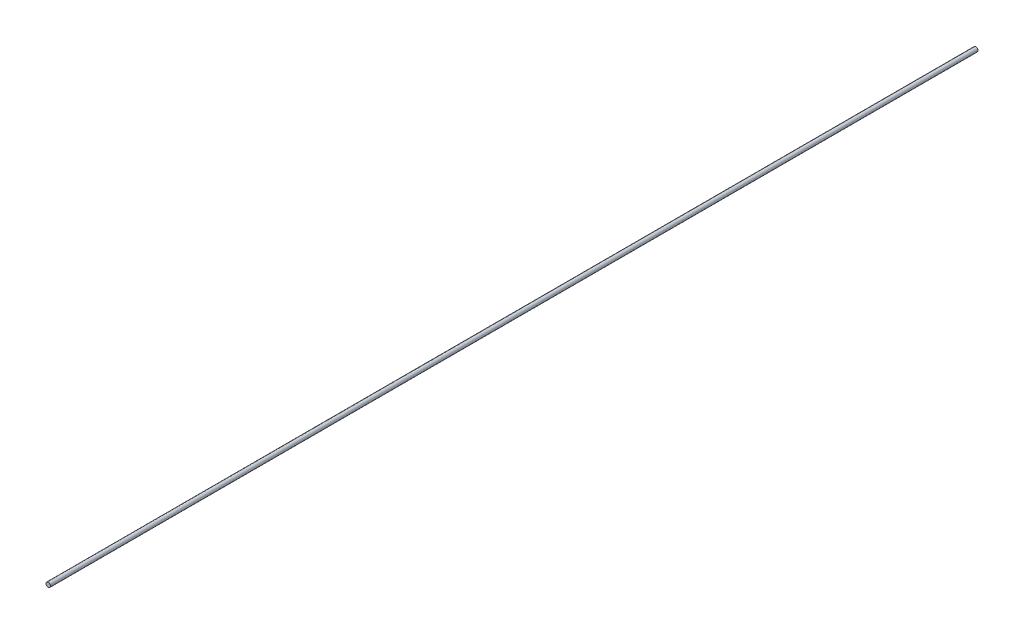
ISO-10303-21;
HEADER;
FILE_DESCRIPTION(('STEP AP214'),'2;1');
FILE_NAME('part.step','',(''),(''),'','','');
FILE_SCHEMA(('AUTOMOTIVE_DESIGN { 1 0 10303 214 1 1 1 1 }'));
ENDSEC;
DATA;
#1=APPLICATION_CONTEXT('core data for automotive mechanical design processes');
#2=APPLICATION_PROTOCOL_DEFINITION('international standard','automotive_design',2000,#1);
#3=PRODUCT_CONTEXT('',#1,'mechanical');
#4=PRODUCT('Part','Part','',(#3));
#5=PRODUCT_RELATED_PRODUCT_CATEGORY('part','',(#4));
#6=PRODUCT_DEFINITION_FORMATION('','',#4);
#7=PRODUCT_DEFINITION_CONTEXT('part definition',#1,'design');
#8=PRODUCT_DEFINITION('design','',#6,#7);
#9=PRODUCT_DEFINITION_SHAPE('','',#8);
#10=(LENGTH_UNIT() NAMED_UNIT(*) SI_UNIT(.MILLI.,.METRE.));
#11=(NAMED_UNIT(*) PLANE_ANGLE_UNIT() SI_UNIT($,.RADIAN.));
#12=(NAMED_UNIT(*) SI_UNIT($,.STERADIAN.) SOLID_ANGLE_UNIT());
#13=UNCERTAINTY_MEASURE_WITH_UNIT(LENGTH_MEASURE(1.E-05),#10,'distance_accuracy_value','');
#14=(GEOMETRIC_REPRESENTATION_CONTEXT(3) GLOBAL_UNCERTAINTY_ASSIGNED_CONTEXT((#13)) GLOBAL_UNIT_ASSIGNED_CONTEXT((#10,
#11,#12)) REPRESENTATION_CONTEXT('',''));
#15=CARTESIAN_POINT('',(0.,0.,0.));
#16=DIRECTION('',(0.,0.,1.));
#17=DIRECTION('',(1.,0.,0.));
#18=AXIS2_PLACEMENT_3D('',#15,#16,#17);
#19=CARTESIAN_POINT('',(0.,0.,1586.));
#20=DIRECTION('',(0.,0.,-1.));
#21=DIRECTION('',(-1.,0.,0.));
#22=AXIS2_PLACEMENT_3D('',#19,#20,#21);
#23=CYLINDRICAL_SURFACE('',#22,3.8);
#24=CARTESIAN_POINT('',(0.,0.,1586.));
#25=DIRECTION('',(0.,0.,1.));
#26=DIRECTION('',(1.,0.,0.));
#27=AXIS2_PLACEMENT_3D('',#24,#25,#26);
#28=CIRCLE('',#27,3.8);
#29=CARTESIAN_POINT('',(3.8,0.,1586.));
#30=VERTEX_POINT('',#29);
#31=EDGE_CURVE('E10',#30,#30,#28,.T.);
#32=ORIENTED_EDGE('',*,*,#31,.F.);
#33=EDGE_LOOP('',(#32));
#34=FACE_BOUND('',#33,.T.);
#35=CARTESIAN_POINT('',(0.,0.,0.));
#36=DIRECTION('',(0.,0.,1.));
#37=DIRECTION('',(1.,0.,0.));
#38=AXIS2_PLACEMENT_3D('',#35,#36,#37);
#39=CIRCLE('',#38,3.8);
#40=CARTESIAN_POINT('',(3.8,0.,0.));
#41=VERTEX_POINT('',#40);
#42=EDGE_CURVE('E40',#41,#41,#39,.T.);
#43=ORIENTED_EDGE('',*,*,#42,.T.);
#44=EDGE_LOOP('',(#43));
#45=FACE_BOUND('',#44,.T.);
#46=ADVANCED_FACE('F37',(#34,#45),#23,.T.);
#47=CARTESIAN_POINT('',(0.,0.,1586.));
#48=DIRECTION('',(0.,0.,1.));
#49=DIRECTION('',(1.,0.,0.));
#50=AXIS2_PLACEMENT_3D('',#47,#48,#49);
#51=PLANE('',#50);
#52=ORIENTED_EDGE('',*,*,#31,.T.);
#53=EDGE_LOOP('',(#52));
#54=FACE_BOUND('',#53,.T.);
#55=ADVANCED_FACE('F54',(#54),#51,.T.);
#56=CARTESIAN_POINT('',(0.,0.,0.));
#57=DIRECTION('',(0.,0.,1.));
#58=DIRECTION('',(1.,0.,0.));
#59=AXIS2_PLACEMENT_3D('',#56,#57,#58);
#60=PLANE('',#59);
#61=ORIENTED_EDGE('',*,*,#42,.F.);
#62=EDGE_LOOP('',(#61));
#63=FACE_BOUND('',#62,.T.);
#64=ADVANCED_FACE('F52',(#63),#60,.F.);
#65=CLOSED_SHELL('',(#46,#55,#64));
#66=MANIFOLD_SOLID_BREP('B2',#65);
#67=ADVANCED_BREP_SHAPE_REPRESENTATION('',(#18,#66),#14);
#68=SHAPE_DEFINITION_REPRESENTATION(#9,#67);
ENDSEC;
END-ISO-10303-21;
